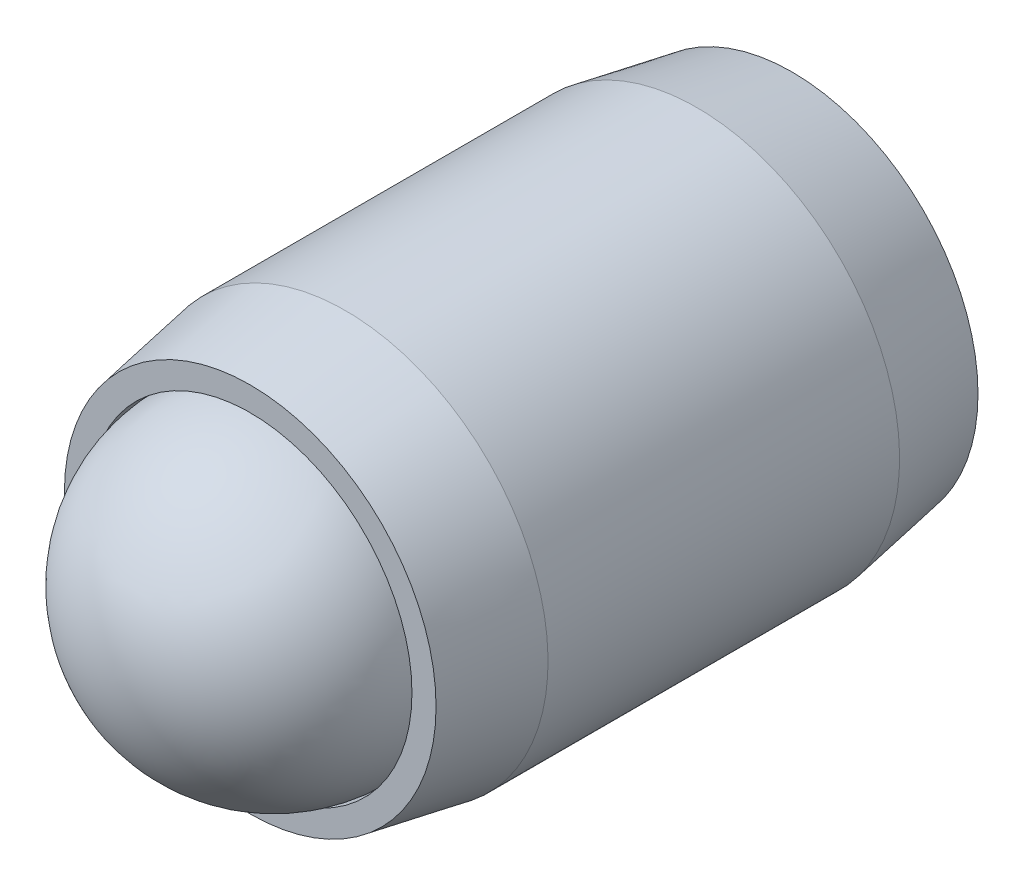
ISO-10303-21;
HEADER;
FILE_DESCRIPTION(('STEP AP214'),'2;1');
FILE_NAME('part.step','',(''),(''),'','','');
FILE_SCHEMA(('AUTOMOTIVE_DESIGN { 1 0 10303 214 1 1 1 1 }'));
ENDSEC;
DATA;
#1=APPLICATION_CONTEXT('core data for automotive mechanical design processes');
#2=APPLICATION_PROTOCOL_DEFINITION('international standard','automotive_design',2000,#1);
#3=PRODUCT_CONTEXT('',#1,'mechanical');
#4=PRODUCT('Part','Part','',(#3));
#5=PRODUCT_RELATED_PRODUCT_CATEGORY('part','',(#4));
#6=PRODUCT_DEFINITION_FORMATION('','',#4);
#7=PRODUCT_DEFINITION_CONTEXT('part definition',#1,'design');
#8=PRODUCT_DEFINITION('design','',#6,#7);
#9=PRODUCT_DEFINITION_SHAPE('','',#8);
#10=(LENGTH_UNIT() NAMED_UNIT(*) SI_UNIT(.MILLI.,.METRE.));
#11=(NAMED_UNIT(*) PLANE_ANGLE_UNIT() SI_UNIT($,.RADIAN.));
#12=(NAMED_UNIT(*) SI_UNIT($,.STERADIAN.) SOLID_ANGLE_UNIT());
#13=UNCERTAINTY_MEASURE_WITH_UNIT(LENGTH_MEASURE(1.E-05),#10,'distance_accuracy_value','');
#14=(GEOMETRIC_REPRESENTATION_CONTEXT(3) GLOBAL_UNCERTAINTY_ASSIGNED_CONTEXT((#13)) GLOBAL_UNIT_ASSIGNED_CONTEXT((#10,
#11,#12)) REPRESENTATION_CONTEXT('',''));
#15=CARTESIAN_POINT('',(0.,0.,0.));
#16=DIRECTION('',(0.,0.,1.));
#17=DIRECTION('',(1.,0.,0.));
#18=AXIS2_PLACEMENT_3D('',#15,#16,#17);
#19=CARTESIAN_POINT('',(0.,0.,4.));
#20=DIRECTION('',(0.,0.,-1.));
#21=DIRECTION('',(-1.,0.,0.));
#22=AXIS2_PLACEMENT_3D('',#19,#20,#21);
#23=CYLINDRICAL_SURFACE('',#22,2.991);
#24=CARTESIAN_POINT('',(0.,0.,2.59465636509867));
#25=DIRECTION('',(0.,0.,1.));
#26=DIRECTION('',(0.,-1.,0.));
#27=AXIS2_PLACEMENT_3D('',#24,#25,#26);
#28=CIRCLE('',#27,2.991);
#29=CARTESIAN_POINT('',(0.,-2.991,2.59465636509867));
#30=VERTEX_POINT('',#29);
#31=EDGE_CURVE('P0_E184',#30,#30,#28,.T.);
#32=ORIENTED_EDGE('',*,*,#31,.F.);
#33=EDGE_LOOP('',(#32));
#34=FACE_BOUND('',#33,.T.);
#35=CARTESIAN_POINT('',(0.,0.,-2.59465636509867));
#36=DIRECTION('',(0.,0.,1.));
#37=DIRECTION('',(0.,-1.,0.));
#38=AXIS2_PLACEMENT_3D('',#35,#36,#37);
#39=CIRCLE('',#38,2.991);
#40=CARTESIAN_POINT('',(0.,-2.991,-2.59465636509867));
#41=VERTEX_POINT('',#40);
#42=EDGE_CURVE('P0_E187',#41,#41,#39,.T.);
#43=ORIENTED_EDGE('',*,*,#42,.T.);
#44=EDGE_LOOP('',(#43));
#45=FACE_BOUND('',#44,.T.);
#46=ADVANCED_FACE('P0_F16',(#34,#45),#23,.T.);
#47=CARTESIAN_POINT('',(0.,0.,4.));
#48=DIRECTION('',(0.,0.,-1.));
#49=DIRECTION('',(0.,1.,0.));
#50=AXIS2_PLACEMENT_3D('',#47,#48,#49);
#51=CONICAL_SURFACE('',#50,2.7432,0.174532925199426);
#52=ORIENTED_EDGE('',*,*,#31,.T.);
#53=EDGE_LOOP('',(#52));
#54=FACE_BOUND('',#53,.T.);
#55=CARTESIAN_POINT('',(0.,0.,4.));
#56=DIRECTION('',(0.,0.,1.));
#57=DIRECTION('',(0.,-1.,0.));
#58=AXIS2_PLACEMENT_3D('',#55,#56,#57);
#59=CIRCLE('',#58,2.7432);
#60=CARTESIAN_POINT('',(0.,-2.7432,4.));
#61=VERTEX_POINT('',#60);
#62=EDGE_CURVE('P0_E200',#61,#61,#59,.T.);
#63=ORIENTED_EDGE('',*,*,#62,.F.);
#64=EDGE_LOOP('',(#63));
#65=FACE_BOUND('',#64,.T.);
#66=ADVANCED_FACE('P0_F162',(#54,#65),#51,.T.);
#67=CARTESIAN_POINT('',(0.,0.,4.));
#68=DIRECTION('',(0.,0.,1.));
#69=DIRECTION('',(1.,0.,0.));
#70=AXIS2_PLACEMENT_3D('',#67,#68,#69);
#71=PLANE('',#70);
#72=CARTESIAN_POINT('',(0.,0.,4.));
#73=DIRECTION('',(0.,0.,1.));
#74=DIRECTION('',(1.,0.,0.));
#75=AXIS2_PLACEMENT_3D('',#72,#73,#74);
#76=CIRCLE('',#75,2.3876);
#77=CARTESIAN_POINT('',(2.3876,0.,4.));
#78=VERTEX_POINT('',#77);
#79=EDGE_CURVE('P0_E195',#78,#78,#76,.T.);
#80=ORIENTED_EDGE('',*,*,#79,.F.);
#81=EDGE_LOOP('',(#80));
#82=FACE_BOUND('',#81,.T.);
#83=ORIENTED_EDGE('',*,*,#62,.T.);
#84=EDGE_LOOP('',(#83));
#85=FACE_BOUND('',#84,.T.);
#86=ADVANCED_FACE('P0_F159',(#82,#85),#71,.T.);
#87=CARTESIAN_POINT('',(0.,0.,-2.59465636509867));
#88=DIRECTION('',(0.,0.,1.));
#89=DIRECTION('',(0.,-1.,0.));
#90=AXIS2_PLACEMENT_3D('',#87,#88,#89);
#91=CONICAL_SURFACE('',#90,2.991,0.174532925199426);
#92=CARTESIAN_POINT('',(0.,0.,-4.));
#93=DIRECTION('',(0.,0.,1.));
#94=DIRECTION('',(0.,-1.,0.));
#95=AXIS2_PLACEMENT_3D('',#92,#93,#94);
#96=CIRCLE('',#95,2.7432);
#97=CARTESIAN_POINT('',(0.,-2.7432,-4.));
#98=VERTEX_POINT('',#97);
#99=EDGE_CURVE('P0_E189',#98,#98,#96,.T.);
#100=ORIENTED_EDGE('',*,*,#99,.T.);
#101=EDGE_LOOP('',(#100));
#102=FACE_BOUND('',#101,.T.);
#103=ORIENTED_EDGE('',*,*,#42,.F.);
#104=EDGE_LOOP('',(#103));
#105=FACE_BOUND('',#104,.T.);
#106=ADVANCED_FACE('P0_F161',(#102,#105),#91,.T.);
#107=CARTESIAN_POINT('',(0.,0.,-4.));
#108=DIRECTION('',(0.,0.,1.));
#109=DIRECTION('',(1.,0.,0.));
#110=AXIS2_PLACEMENT_3D('',#107,#108,#109);
#111=PLANE('',#110);
#112=CARTESIAN_POINT('',(0.,0.,-4.));
#113=DIRECTION('',(0.,0.,1.));
#114=DIRECTION('',(1.,0.,0.));
#115=AXIS2_PLACEMENT_3D('',#112,#113,#114);
#116=CIRCLE('',#115,1.14567944042316);
#117=CARTESIAN_POINT('',(0.572839720211582,-0.9921875,-4.));
#118=VERTEX_POINT('',#117);
#119=CARTESIAN_POINT('',(1.14567944042316,0.,-4.));
#120=VERTEX_POINT('',#119);
#121=EDGE_CURVE('P0_E19',#118,#120,#116,.T.);
#122=ORIENTED_EDGE('',*,*,#121,.T.);
#123=CARTESIAN_POINT('',(0.572839720211581,0.9921875,-4.));
#124=VERTEX_POINT('',#123);
#125=EDGE_CURVE('P0_E11',#120,#124,#116,.T.);
#126=ORIENTED_EDGE('',*,*,#125,.T.);
#127=CARTESIAN_POINT('',(-0.572839720211581,0.9921875,-4.));
#128=VERTEX_POINT('',#127);
#129=EDGE_CURVE('P0_E24',#124,#128,#116,.T.);
#130=ORIENTED_EDGE('',*,*,#129,.T.);
#131=CARTESIAN_POINT('',(0.,0.,-4.));
#132=DIRECTION('',(0.,0.,-1.));
#133=DIRECTION('',(-1.,0.,0.));
#134=AXIS2_PLACEMENT_3D('',#131,#132,#133);
#135=CIRCLE('',#134,1.14567944042316);
#136=CARTESIAN_POINT('',(-1.14567944042316,0.,-4.));
#137=VERTEX_POINT('',#136);
#138=EDGE_CURVE('P0_E77',#137,#128,#135,.T.);
#139=ORIENTED_EDGE('',*,*,#138,.F.);
#140=CARTESIAN_POINT('',(-0.572839720211582,-0.9921875,-4.));
#141=VERTEX_POINT('',#140);
#142=EDGE_CURVE('P0_E85',#137,#141,#116,.T.);
#143=ORIENTED_EDGE('',*,*,#142,.T.);
#144=EDGE_CURVE('P0_E90',#141,#118,#116,.T.);
#145=ORIENTED_EDGE('',*,*,#144,.T.);
#146=EDGE_LOOP('',(#122,#126,#130,#139,#143,#145));
#147=FACE_BOUND('',#146,.T.);
#148=ORIENTED_EDGE('',*,*,#99,.F.);
#149=EDGE_LOOP('',(#148));
#150=FACE_BOUND('',#149,.T.);
#151=ADVANCED_FACE('P0_F91',(#147,#150),#111,.F.);
#152=CARTESIAN_POINT('',(0.,0.,2.67075395459906));
#153=DIRECTION('',(0.,0.,1.));
#154=DIRECTION('',(1.,0.,0.));
#155=AXIS2_PLACEMENT_3D('',#152,#153,#154);
#156=CONICAL_SURFACE('',#155,2.3876,0.78539816339745);
#157=CARTESIAN_POINT('',(0.,0.,0.283153954599072));
#158=VERTEX_POINT('',#157);
#159=VERTEX_LOOP('',#158);
#160=FACE_BOUND('',#159,.T.);
#161=CARTESIAN_POINT('',(0.,0.,2.67075395459906));
#162=DIRECTION('',(0.,0.,1.));
#163=DIRECTION('',(1.,0.,0.));
#164=AXIS2_PLACEMENT_3D('',#161,#162,#163);
#165=CIRCLE('',#164,2.3876);
#166=CARTESIAN_POINT('',(2.3876,0.,2.67075395459906));
#167=VERTEX_POINT('',#166);
#168=EDGE_CURVE('P0_E190',#167,#167,#165,.T.);
#169=ORIENTED_EDGE('',*,*,#168,.T.);
#170=EDGE_LOOP('',(#169));
#171=FACE_BOUND('',#170,.T.);
#172=ADVANCED_FACE('P0_F165',(#160,#171),#156,.F.);
#173=CARTESIAN_POINT('',(0.,0.,4.));
#174=DIRECTION('',(0.,0.,1.));
#175=DIRECTION('',(1.,0.,0.));
#176=AXIS2_PLACEMENT_3D('',#173,#174,#175);
#177=CYLINDRICAL_SURFACE('',#176,2.3876);
#178=ORIENTED_EDGE('',*,*,#168,.F.);
#179=EDGE_LOOP('',(#178));
#180=FACE_BOUND('',#179,.T.);
#181=ORIENTED_EDGE('',*,*,#79,.T.);
#182=EDGE_LOOP('',(#181));
#183=FACE_BOUND('',#182,.T.);
#184=ADVANCED_FACE('P0_F132',(#180,#183),#177,.F.);
#185=CARTESIAN_POINT('',(0.,0.,-4.));
#186=DIRECTION('',(0.,0.,-1.));
#187=DIRECTION('',(-1.,0.,0.));
#188=AXIS2_PLACEMENT_3D('',#185,#186,#187);
#189=CONICAL_SURFACE('',#188,1.14567944042316,0.78539816339745);
#190=ORIENTED_EDGE('',*,*,#121,.F.);
#191=CARTESIAN_POINT('',(1.145794910477,0.000200000000000088,-4.00011548750897));
#192=CARTESIAN_POINT('',(1.12609913995856,-0.0339140752321559,-3.98043281140465));
#193=CARTESIAN_POINT('',(1.10607402631377,-0.0685985894922798,-3.96190568451841));
#194=CARTESIAN_POINT('',(1.06524035596264,-0.139324581199959,-3.92798232965041));
#195=CARTESIAN_POINT('',(1.04442791197037,-0.175372791624243,-3.91260498723095));
#196=CARTESIAN_POINT('',(1.00246048249572,-0.248062511737396,-3.88626314273428));
#197=CARTESIAN_POINT('',(0.981316196707012,-0.284685489013202,-3.87523239651314));
#198=CARTESIAN_POINT('',(0.938562244623588,-0.358737506246057,-3.85823620567294));
#199=CARTESIAN_POINT('',(0.916953885244212,-0.396164282559343,-3.85225806757892));
#200=CARTESIAN_POINT('',(0.879714587318153,-0.460664638605472,-3.84686634491429));
#201=CARTESIAN_POINT('',(0.864132099442441,-0.48765429931453,-3.84606899638834));
#202=CARTESIAN_POINT('',(0.832997298779852,-0.541581355945665,-3.84740819336142));
#203=CARTESIAN_POINT('',(0.817444993408172,-0.56851873902424,-3.84954538613705));
#204=CARTESIAN_POINT('',(0.771010163908484,-0.648946222958498,-3.86021757130602));
#205=CARTESIAN_POINT('',(0.740358726795445,-0.702036069363283,-3.87301438072271));
#206=CARTESIAN_POINT('',(0.686562055130079,-0.795214637965798,-3.90389746765013));
#207=CARTESIAN_POINT('',(0.663164549602744,-0.835740306309517,-3.92036500890771));
#208=CARTESIAN_POINT('',(0.617285982385523,-0.915204315708207,-3.95746038355681));
#209=CARTESIAN_POINT('',(0.594802217831308,-0.954147338261523,-3.97807468064554));
#210=CARTESIAN_POINT('',(0.572724250157744,-0.9923875,-4.00011548750897));
#211=B_SPLINE_CURVE_WITH_KNOTS('',3,(#191,#192,#193,#194,#195,#196,#197,#198,#199,#200,#201,
#202,#203,#204,#205,#206,#207,#208,#209,#210),.UNSPECIFIED.,.F.,.F.,(4,2,2,2,2,2,2,2,2,4),(0.,
0.132197185210191,0.265165186853263,0.39602009760567,0.526545281028575,0.619935205043266,
0.713345731536166,0.90022005184637,1.04884529769095,1.1969930355767),.UNSPECIFIED.);
#212=EDGE_CURVE('P0_E109',#120,#118,#211,.T.);
#213=ORIENTED_EDGE('',*,*,#212,.F.);
#214=EDGE_LOOP('',(#190,#213));
#215=FACE_BOUND('',#214,.T.);
#216=ADVANCED_FACE('P0_F127',(#215),#189,.F.);
#217=ORIENTED_EDGE('',*,*,#144,.F.);
#218=CARTESIAN_POINT('',(-1.14247621078911,-0.9921875,-4.36749203940828));
#219=CARTESIAN_POINT('',(-1.11465764801141,-0.9921875,-4.3464916392497));
#220=CARTESIAN_POINT('',(-1.08668408094051,-0.9921875,-4.32569714770579));
#221=CARTESIAN_POINT('',(-1.03036405365904,-0.9921875,-4.28460503768691));
#222=CARTESIAN_POINT('',(-1.00201750223733,-0.9921875,-4.26430754435707));
#223=CARTESIAN_POINT('',(-0.915909012346496,-0.9921875,-4.20399850749393));
#224=CARTESIAN_POINT('',(-0.857501195839066,-0.9921875,-4.16489385217264));
#225=CARTESIAN_POINT('',(-0.735022281240404,-0.9921875,-4.08812675276114));
#226=CARTESIAN_POINT('',(-0.670818221894543,-0.9921875,-4.05067403099626));
#227=CARTESIAN_POINT('',(-0.539203244212803,-0.9921875,-3.98216502046105));
#228=CARTESIAN_POINT('',(-0.471804118965062,-0.9921875,-3.95108716825431));
#229=CARTESIAN_POINT('',(-0.370637445252798,-0.9921875,-3.91306629623627));
#230=CARTESIAN_POINT('',(-0.338367677251604,-0.9921875,-3.90215403233245));
#231=CARTESIAN_POINT('',(-0.273049086247197,-0.9921875,-3.88292023009933));
#232=CARTESIAN_POINT('',(-0.240000209742886,-0.9921875,-3.87459887024719));
#233=CARTESIAN_POINT('',(-0.173878395816094,-0.9921875,-3.86111877368215));
#234=CARTESIAN_POINT('',(-0.14081677471647,-0.9921875,-3.85590539396509));
#235=CARTESIAN_POINT('',(-0.074329167199214,-0.9921875,-3.84873971245706));
#236=CARTESIAN_POINT('',(-0.040903125991957,-0.9921875,-3.84678790803543));
#237=CARTESIAN_POINT('',(0.0247631141129258,-0.9921875,-3.84629348590571));
#238=CARTESIAN_POINT('',(0.0570024445003674,-0.9921875,-3.84763003142075));
#239=CARTESIAN_POINT('',(0.121194220501071,-0.9921875,-3.85337104321384));
#240=CARTESIAN_POINT('',(0.153146730366263,-0.9921875,-3.85777480409387));
#241=CARTESIAN_POINT('',(0.217090524657737,-0.9921875,-3.86948451115969));
#242=CARTESIAN_POINT('',(0.249072542149665,-0.9921875,-3.87684030243665));
#243=CARTESIAN_POINT('',(0.312337779758396,-0.9921875,-3.8940630913854));
#244=CARTESIAN_POINT('',(0.343621058108106,-0.9921875,-3.90392987893501));
#245=CARTESIAN_POINT('',(0.442112983138563,-0.9921875,-3.93870611159688));
#246=CARTESIAN_POINT('',(0.50791977119888,-0.9921875,-3.96757616415081));
#247=CARTESIAN_POINT('',(0.636441891183645,-0.9921875,-4.03176520992333));
#248=CARTESIAN_POINT('',(0.699145053961295,-0.9921875,-4.06710737220965));
#249=CARTESIAN_POINT('',(0.818979830095495,-0.9921875,-4.14002137086766));
#250=CARTESIAN_POINT('',(0.876233471712469,-0.9921875,-4.17739513504847));
#251=CARTESIAN_POINT('',(0.960585190784999,-0.9921875,-4.23517111190454));
#252=CARTESIAN_POINT('',(0.98833837842419,-0.9921875,-4.25463348767096));
#253=CARTESIAN_POINT('',(1.04346551341387,-0.9921875,-4.29407298177173));
#254=CARTESIAN_POINT('',(1.07083956239906,-0.9921875,-4.31404995788478));
#255=CARTESIAN_POINT('',(1.09805574523311,-0.9921875,-4.33424030564271));
#256=B_SPLINE_CURVE_WITH_KNOTS('',3,(#218,#219,#220,#221,#222,#223,#224,#225,#226,#227,#228,
#229,#230,#231,#232,#233,#234,#235,#236,#237,#238,#239,#240,#241,#242,#243,#244,#245,#246,#247,
#248,#249,#250,#251,#252,#253,#254,#255),.UNSPECIFIED.,.F.,.F.,(4,2,2,2,2,2,2,2,2,2,2,2,2,2,2,2,
2,2,4),(0.,0.104563127371702,0.209152318679108,0.419927098975113,0.642732653870155,
0.864771652131276,0.966879847039377,1.06899507422301,1.16925752982867,1.26953527342202,
1.36618351686957,1.46280954049584,1.56114078094885,1.65946379566813,1.87441437168727,
2.09015003608822,2.29516517576016,2.39685303378669,2.49851308339968),.UNSPECIFIED.);
#257=EDGE_CURVE('P0_E107',#118,#141,#256,.F.);
#258=ORIENTED_EDGE('',*,*,#257,.F.);
#259=EDGE_LOOP('',(#217,#258));
#260=FACE_BOUND('',#259,.T.);
#261=ADVANCED_FACE('P0_F131',(#260),#189,.F.);
#262=ORIENTED_EDGE('',*,*,#142,.F.);
#263=CARTESIAN_POINT('',(-0.572724250157744,-0.9923875,-4.00011548750897));
#264=CARTESIAN_POINT('',(-0.592420020676185,-0.958273424767844,-3.98043281140465));
#265=CARTESIAN_POINT('',(-0.612445134320978,-0.92358891050772,-3.96190568451841));
#266=CARTESIAN_POINT('',(-0.653278804672111,-0.85286291880004,-3.92798232965041));
#267=CARTESIAN_POINT('',(-0.674091248664375,-0.816814708375757,-3.91260498723095));
#268=CARTESIAN_POINT('',(-0.716058678139022,-0.744124988262603,-3.88626314273428));
#269=CARTESIAN_POINT('',(-0.737202963927734,-0.707502010986798,-3.87523239651314));
#270=CARTESIAN_POINT('',(-0.779956916011158,-0.633449993753943,-3.85823620567294));
#271=CARTESIAN_POINT('',(-0.801565275390534,-0.596023217440656,-3.85225806757892));
#272=CARTESIAN_POINT('',(-0.838804573316593,-0.531522861394528,-3.84686634491429));
#273=CARTESIAN_POINT('',(-0.854387061192304,-0.50453320068547,-3.84606899638834));
#274=CARTESIAN_POINT('',(-0.885521861854894,-0.450606144054335,-3.84740819336142));
#275=CARTESIAN_POINT('',(-0.901074167226574,-0.42366876097576,-3.84954538613705));
#276=CARTESIAN_POINT('',(-0.947508996726262,-0.343241277041502,-3.86021757130602));
#277=CARTESIAN_POINT('',(-0.978160433839301,-0.290151430636716,-3.87301438072271));
#278=CARTESIAN_POINT('',(-1.03195710550467,-0.196972862034202,-3.90389746765013));
#279=CARTESIAN_POINT('',(-1.055354611032,-0.156447193690483,-3.92036500890771));
#280=CARTESIAN_POINT('',(-1.10123317824922,-0.0769831842917924,-3.95746038355681));
#281=CARTESIAN_POINT('',(-1.12371694280344,-0.0380401617384764,-3.97807468064554));
#282=CARTESIAN_POINT('',(-1.145794910477,0.00019999999999987,-4.00011548750897));
#283=B_SPLINE_CURVE_WITH_KNOTS('',3,(#263,#264,#265,#266,#267,#268,#269,#270,#271,#272,#273,
#274,#275,#276,#277,#278,#279,#280,#281,#282),.UNSPECIFIED.,.F.,.F.,(4,2,2,2,2,2,2,2,2,4),(0.,
0.13219718521019,0.265165186853263,0.39602009760567,0.526545281028575,0.619935205043265,
0.713345731536165,0.90022005184637,1.04884529769095,1.19699303557669),.UNSPECIFIED.);
#284=EDGE_CURVE('P0_E80',#141,#137,#283,.T.);
#285=ORIENTED_EDGE('',*,*,#284,.F.);
#286=EDGE_LOOP('',(#262,#285));
#287=FACE_BOUND('',#286,.T.);
#288=ADVANCED_FACE('P0_F86',(#287),#189,.F.);
#289=ORIENTED_EDGE('',*,*,#138,.T.);
#290=CARTESIAN_POINT('',(-1.145794910477,-0.00019999999999985,-4.00011548750897));
#291=CARTESIAN_POINT('',(-1.12609913995856,0.0339140752321559,-3.98043281140465));
#292=CARTESIAN_POINT('',(-1.10607402631377,0.0685985894922795,-3.96190568451841));
#293=CARTESIAN_POINT('',(-1.06524035596264,0.139324581199959,-3.92798232965041));
#294=CARTESIAN_POINT('',(-1.04442791197037,0.175372791624242,-3.91260498723095));
#295=CARTESIAN_POINT('',(-1.00246048249572,0.248062511737396,-3.88626314273428));
#296=CARTESIAN_POINT('',(-0.981316196707011,0.284685489013201,-3.87523239651314));
#297=CARTESIAN_POINT('',(-0.938562244623588,0.358737506246056,-3.85823620567294));
#298=CARTESIAN_POINT('',(-0.916953885244212,0.396164282559343,-3.85225806757892));
#299=CARTESIAN_POINT('',(-0.879714587318153,0.460664638605471,-3.84686634491429));
#300=CARTESIAN_POINT('',(-0.864132099442442,0.487654299314529,-3.84606899638834));
#301=CARTESIAN_POINT('',(-0.832997298779852,0.541581355945664,-3.84740819336142));
#302=CARTESIAN_POINT('',(-0.817444993408172,0.568518739024239,-3.84954538613705));
#303=CARTESIAN_POINT('',(-0.771010163908484,0.648946222958497,-3.86021757130602));
#304=CARTESIAN_POINT('',(-0.740358726795446,0.702036069363283,-3.87301438072271));
#305=CARTESIAN_POINT('',(-0.68656205513008,0.795214637965797,-3.90389746765013));
#306=CARTESIAN_POINT('',(-0.663164549602744,0.835740306309517,-3.92036500890771));
#307=CARTESIAN_POINT('',(-0.617285982385522,0.915204315708207,-3.95746038355681));
#308=CARTESIAN_POINT('',(-0.594802217831308,0.954147338261524,-3.97807468064554));
#309=CARTESIAN_POINT('',(-0.572724250157744,0.9923875,-4.00011548750897));
#310=B_SPLINE_CURVE_WITH_KNOTS('',3,(#290,#291,#292,#293,#294,#295,#296,#297,#298,#299,#300,
#301,#302,#303,#304,#305,#306,#307,#308,#309),.UNSPECIFIED.,.F.,.F.,(4,2,2,2,2,2,2,2,2,4),(0.,
0.13219718521019,0.265165186853262,0.396020097605669,0.526545281028574,0.619935205043264,
0.713345731536164,0.900220051846369,1.04884529769095,1.1969930355767),.UNSPECIFIED.);
#311=EDGE_CURVE('P0_E73',#137,#128,#310,.T.);
#312=ORIENTED_EDGE('',*,*,#311,.F.);
#313=EDGE_LOOP('',(#289,#312));
#314=FACE_BOUND('',#313,.T.);
#315=ADVANCED_FACE('P0_F75',(#314),#189,.F.);
#316=ORIENTED_EDGE('',*,*,#129,.F.);
#317=CARTESIAN_POINT('',(-1.14247621095534,0.9921875,-4.36749203953379));
#318=CARTESIAN_POINT('',(-1.11465764817297,0.9921875,-4.34649163937037));
#319=CARTESIAN_POINT('',(-1.08668408109739,0.9921875,-4.32569714782163));
#320=CARTESIAN_POINT('',(-1.03036405380652,0.9921875,-4.28460503779312));
#321=CARTESIAN_POINT('',(-1.00201750238008,0.9921875,-4.26430754445849));
#322=CARTESIAN_POINT('',(-0.915909012474783,0.9921875,-4.20399850758086));
#323=CARTESIAN_POINT('',(-0.857501195957518,0.9921875,-4.16489385224995));
#324=CARTESIAN_POINT('',(-0.735022281337405,0.9921875,-4.08812675281867));
#325=CARTESIAN_POINT('',(-0.670818221979871,0.9921875,-4.0506740310437));
#326=CARTESIAN_POINT('',(-0.539203244273795,0.9921875,-3.98216502048978));
#327=CARTESIAN_POINT('',(-0.471804119013397,0.9921875,-3.95108716827442));
#328=CARTESIAN_POINT('',(-0.370637445291611,0.9921875,-3.91306629624996));
#329=CARTESIAN_POINT('',(-0.338367677294404,0.9921875,-3.9021540323464));
#330=CARTESIAN_POINT('',(-0.273049086298104,0.9921875,-3.88292023011298));
#331=CARTESIAN_POINT('',(-0.240000209797912,0.9921875,-3.87459887026028));
#332=CARTESIAN_POINT('',(-0.173878395879219,0.9921875,-3.86111877369319));
#333=CARTESIAN_POINT('',(-0.140816774783574,0.9921875,-3.85590539397466));
#334=CARTESIAN_POINT('',(-0.074329167274146,0.9921875,-3.8487397124628));
#335=CARTESIAN_POINT('',(-0.0409031260707377,0.9921875,-3.8467879080388));
#336=CARTESIAN_POINT('',(0.0247631140270454,0.9921875,-3.84629348590368));
#337=CARTESIAN_POINT('',(0.0570024444112259,0.9921875,-3.84763003141573));
#338=CARTESIAN_POINT('',(0.121194220405734,0.9921875,-3.85337104320236));
#339=CARTESIAN_POINT('',(0.153146730267991,0.9921875,-3.85777480407894));
#340=CARTESIAN_POINT('',(0.217090524553671,0.9921875,-3.86948451113752));
#341=CARTESIAN_POINT('',(0.249072542042749,0.9921875,-3.87684030241066));
#342=CARTESIAN_POINT('',(0.312337779646056,0.9921875,-3.89406309135171));
#343=CARTESIAN_POINT('',(0.34362105799319,0.9921875,-3.90392987889742));
#344=CARTESIAN_POINT('',(0.442112982998624,0.9921875,-3.93870611154092));
#345=CARTESIAN_POINT('',(0.507919771037747,0.9921875,-3.96757616407796));
#346=CARTESIAN_POINT('',(0.636441890981752,0.9921875,-4.03176520981482));
#347=CARTESIAN_POINT('',(0.699145053739845,0.9921875,-4.06710737208238));
#348=CARTESIAN_POINT('',(0.818979829838884,0.9921875,-4.14002137070446));
#349=CARTESIAN_POINT('',(0.876233471440129,0.9921875,-4.17739513486827));
#350=CARTESIAN_POINT('',(0.960585190489402,0.9921875,-4.23517111169895));
#351=CARTESIAN_POINT('',(0.988338378120952,0.9921875,-4.25463348745697));
#352=CARTESIAN_POINT('',(1.0434655130954,0.9921875,-4.29407298154095));
#353=CARTESIAN_POINT('',(1.070839562073,0.9921875,-4.31404995764561));
#354=CARTESIAN_POINT('',(1.09805574489947,0.9921875,-4.33424030539516));
#355=B_SPLINE_CURVE_WITH_KNOTS('',3,(#317,#318,#319,#320,#321,#322,#323,#324,#325,#326,#327,
#328,#329,#330,#331,#332,#333,#334,#335,#336,#337,#338,#339,#340,#341,#342,#343,#344,#345,#346,
#347,#348,#349,#350,#351,#352,#353,#354),.UNSPECIFIED.,.F.,.F.,(4,2,2,2,2,2,2,2,2,2,2,2,2,2,2,2,
2,2,4),(0.,0.104563127391605,0.209152318718919,0.419927099055486,0.642732653996013,
0.864771652302187,0.966879847198757,1.06899507437088,1.1692575299655,1.2695352735478,
1.36618351698525,1.4628095406014,1.56114078104352,1.65946379575192,1.87441437169281,
2.090150036015,2.29516517561956,2.39685303361285,2.4985130831926),.UNSPECIFIED.);
#356=EDGE_CURVE('P0_E81',#128,#124,#355,.T.);
#357=ORIENTED_EDGE('',*,*,#356,.F.);
#358=EDGE_LOOP('',(#316,#357));
#359=FACE_BOUND('',#358,.T.);
#360=ADVANCED_FACE('P0_F231',(#359),#189,.F.);
#361=ORIENTED_EDGE('',*,*,#125,.F.);
#362=CARTESIAN_POINT('',(0.572724250157744,0.9923875,-4.00011548750897));
#363=CARTESIAN_POINT('',(0.592420020676184,0.958273424767844,-3.98043281140465));
#364=CARTESIAN_POINT('',(0.612445134320978,0.92358891050772,-3.96190568451841));
#365=CARTESIAN_POINT('',(0.65327880467211,0.852862918800041,-3.92798232965041));
#366=CARTESIAN_POINT('',(0.674091248664374,0.816814708375758,-3.91260498723095));
#367=CARTESIAN_POINT('',(0.716058678139022,0.744124988262604,-3.88626314273428));
#368=CARTESIAN_POINT('',(0.737202963927734,0.707502010986799,-3.87523239651314));
#369=CARTESIAN_POINT('',(0.779956916011158,0.633449993753943,-3.85823620567294));
#370=CARTESIAN_POINT('',(0.801565275390533,0.596023217440657,-3.85225806757892));
#371=CARTESIAN_POINT('',(0.838804573316592,0.531522861394529,-3.84686634491429));
#372=CARTESIAN_POINT('',(0.854387061192304,0.50453320068547,-3.84606899638834));
#373=CARTESIAN_POINT('',(0.885521861854894,0.450606144054336,-3.84740819336142));
#374=CARTESIAN_POINT('',(0.901074167226573,0.42366876097576,-3.84954538613705));
#375=CARTESIAN_POINT('',(0.947508996726261,0.343241277041503,-3.86021757130602));
#376=CARTESIAN_POINT('',(0.9781604338393,0.290151430636717,-3.87301438072271));
#377=CARTESIAN_POINT('',(1.03195710550467,0.196972862034203,-3.90389746765013));
#378=CARTESIAN_POINT('',(1.055354611032,0.156447193690484,-3.92036500890771));
#379=CARTESIAN_POINT('',(1.10123317824922,0.0769831842917929,-3.95746038355681));
#380=CARTESIAN_POINT('',(1.12371694280344,0.0380401617384766,-3.97807468064554));
#381=CARTESIAN_POINT('',(1.145794910477,-0.00019999999999992,-4.00011548750897));
#382=B_SPLINE_CURVE_WITH_KNOTS('',3,(#362,#363,#364,#365,#366,#367,#368,#369,#370,#371,#372,
#373,#374,#375,#376,#377,#378,#379,#380,#381),.UNSPECIFIED.,.F.,.F.,(4,2,2,2,2,2,2,2,2,4),(0.,
0.13219718521019,0.265165186853263,0.39602009760567,0.526545281028574,0.619935205043265,
0.713345731536164,0.900220051846369,1.04884529769095,1.1969930355767),.UNSPECIFIED.);
#383=EDGE_CURVE('P0_E94',#124,#120,#382,.T.);
#384=ORIENTED_EDGE('',*,*,#383,.F.);
#385=EDGE_LOOP('',(#361,#384));
#386=FACE_BOUND('',#385,.T.);
#387=ADVANCED_FACE('P0_F134',(#386),#189,.F.);
#388=CARTESIAN_POINT('',(0.,0.,-0.952));
#389=DIRECTION('',(0.,0.,-1.));
#390=DIRECTION('',(-1.,0.,0.));
#391=AXIS2_PLACEMENT_3D('',#388,#389,#390);
#392=PLANE('',#391);
#393=DIRECTION('',(1.,0.,0.));
#394=VECTOR('',#393,1.);
#395=CARTESIAN_POINT('',(-0.572839720211581,0.9921875,-0.952));
#396=LINE('',#395,#394);
#397=CARTESIAN_POINT('',(-0.572839720211581,0.9921875,-0.952));
#398=VERTEX_POINT('',#397);
#399=CARTESIAN_POINT('',(0.572839720211582,0.9921875,-0.952));
#400=VERTEX_POINT('',#399);
#401=EDGE_CURVE('P0_E203',#398,#400,#396,.T.);
#402=ORIENTED_EDGE('',*,*,#401,.T.);
#403=DIRECTION('',(0.5,-0.866025403784439,0.));
#404=VECTOR('',#403,1.);
#405=CARTESIAN_POINT('',(0.572839720211582,0.9921875,-0.952));
#406=LINE('',#405,#404);
#407=CARTESIAN_POINT('',(1.14567944042316,0.,-0.952));
#408=VERTEX_POINT('',#407);
#409=EDGE_CURVE('P0_E206',#400,#408,#406,.T.);
#410=ORIENTED_EDGE('',*,*,#409,.T.);
#411=DIRECTION('',(-0.5,-0.866025403784439,0.));
#412=VECTOR('',#411,1.);
#413=CARTESIAN_POINT('',(1.14567944042316,0.,-0.952));
#414=LINE('',#413,#412);
#415=CARTESIAN_POINT('',(0.572839720211582,-0.9921875,-0.952));
#416=VERTEX_POINT('',#415);
#417=EDGE_CURVE('P0_E209',#408,#416,#414,.T.);
#418=ORIENTED_EDGE('',*,*,#417,.T.);
#419=DIRECTION('',(-1.,0.,0.));
#420=VECTOR('',#419,1.);
#421=CARTESIAN_POINT('',(0.572839720211582,-0.9921875,-0.952));
#422=LINE('',#421,#420);
#423=CARTESIAN_POINT('',(-0.572839720211582,-0.9921875,-0.952));
#424=VERTEX_POINT('',#423);
#425=EDGE_CURVE('P0_E212',#416,#424,#422,.T.);
#426=ORIENTED_EDGE('',*,*,#425,.T.);
#427=DIRECTION('',(-0.5,0.866025403784439,0.));
#428=VECTOR('',#427,1.);
#429=CARTESIAN_POINT('',(-0.572839720211582,-0.9921875,-0.952));
#430=LINE('',#429,#428);
#431=CARTESIAN_POINT('',(-1.14567944042316,0.,-0.952));
#432=VERTEX_POINT('',#431);
#433=EDGE_CURVE('P0_E215',#424,#432,#430,.T.);
#434=ORIENTED_EDGE('',*,*,#433,.T.);
#435=DIRECTION('',(0.5,0.866025403784439,0.));
#436=VECTOR('',#435,1.);
#437=CARTESIAN_POINT('',(-1.14567944042316,0.,-0.952));
#438=LINE('',#437,#436);
#439=EDGE_CURVE('P0_E99',#432,#398,#438,.T.);
#440=ORIENTED_EDGE('',*,*,#439,.T.);
#441=EDGE_LOOP('',(#402,#410,#418,#426,#434,#440));
#442=FACE_BOUND('',#441,.T.);
#443=ADVANCED_FACE('P0_F240',(#442),#392,.T.);
#444=CARTESIAN_POINT('',(0.572839720211582,0.9921875,-0.952));
#445=DIRECTION('',(0.866025403784439,0.5,0.));
#446=DIRECTION('',(-0.5,0.866025403784439,0.));
#447=AXIS2_PLACEMENT_3D('',#444,#445,#446);
#448=PLANE('',#447);
#449=DIRECTION('',(0.,0.,-1.));
#450=VECTOR('',#449,1.);
#451=CARTESIAN_POINT('',(0.572839720211582,0.9921875,-0.952));
#452=LINE('',#451,#450);
#453=EDGE_CURVE('P0_E218',#400,#124,#452,.T.);
#454=ORIENTED_EDGE('',*,*,#453,.T.);
#455=ORIENTED_EDGE('',*,*,#383,.T.);
#456=DIRECTION('',(0.,0.,-1.));
#457=VECTOR('',#456,1.);
#458=CARTESIAN_POINT('',(1.14567944042316,0.,-0.952));
#459=LINE('',#458,#457);
#460=EDGE_CURVE('P0_E224',#408,#120,#459,.T.);
#461=ORIENTED_EDGE('',*,*,#460,.F.);
#462=ORIENTED_EDGE('',*,*,#409,.F.);
#463=EDGE_LOOP('',(#454,#455,#461,#462));
#464=FACE_BOUND('',#463,.T.);
#465=ADVANCED_FACE('P0_F155',(#464),#448,.F.);
#466=CARTESIAN_POINT('',(-0.572839720211581,0.9921875,-0.952));
#467=DIRECTION('',(0.,1.,0.));
#468=DIRECTION('',(-1.,0.,0.));
#469=AXIS2_PLACEMENT_3D('',#466,#467,#468);
#470=PLANE('',#469);
#471=DIRECTION('',(0.,0.,-1.));
#472=VECTOR('',#471,1.);
#473=CARTESIAN_POINT('',(-0.572839720211581,0.9921875,-0.952));
#474=LINE('',#473,#472);
#475=EDGE_CURVE('P0_E37',#398,#128,#474,.T.);
#476=ORIENTED_EDGE('',*,*,#475,.T.);
#477=ORIENTED_EDGE('',*,*,#356,.T.);
#478=ORIENTED_EDGE('',*,*,#453,.F.);
#479=ORIENTED_EDGE('',*,*,#401,.F.);
#480=EDGE_LOOP('',(#476,#477,#478,#479));
#481=FACE_BOUND('',#480,.T.);
#482=ADVANCED_FACE('P0_F151',(#481),#470,.F.);
#483=CARTESIAN_POINT('',(-1.14567944042316,0.,-0.952));
#484=DIRECTION('',(-0.866025403784439,0.5,0.));
#485=DIRECTION('',(-0.5,-0.866025403784439,0.));
#486=AXIS2_PLACEMENT_3D('',#483,#484,#485);
#487=PLANE('',#486);
#488=DIRECTION('',(0.,0.,-1.));
#489=VECTOR('',#488,1.);
#490=CARTESIAN_POINT('',(-1.14567944042316,0.,-0.952));
#491=LINE('',#490,#489);
#492=EDGE_CURVE('P0_E96',#432,#137,#491,.T.);
#493=ORIENTED_EDGE('',*,*,#492,.T.);
#494=ORIENTED_EDGE('',*,*,#311,.T.);
#495=ORIENTED_EDGE('',*,*,#475,.F.);
#496=ORIENTED_EDGE('',*,*,#439,.F.);
#497=EDGE_LOOP('',(#493,#494,#495,#496));
#498=FACE_BOUND('',#497,.T.);
#499=ADVANCED_FACE('P0_F97',(#498),#487,.F.);
#500=CARTESIAN_POINT('',(-0.572839720211582,-0.9921875,-0.952));
#501=DIRECTION('',(-0.866025403784439,-0.5,0.));
#502=DIRECTION('',(0.5,-0.866025403784439,0.));
#503=AXIS2_PLACEMENT_3D('',#500,#501,#502);
#504=PLANE('',#503);
#505=DIRECTION('',(0.,0.,-1.));
#506=VECTOR('',#505,1.);
#507=CARTESIAN_POINT('',(-0.572839720211582,-0.9921875,-0.952));
#508=LINE('',#507,#506);
#509=EDGE_CURVE('P0_E103',#424,#141,#508,.T.);
#510=ORIENTED_EDGE('',*,*,#509,.T.);
#511=ORIENTED_EDGE('',*,*,#284,.T.);
#512=ORIENTED_EDGE('',*,*,#492,.F.);
#513=ORIENTED_EDGE('',*,*,#433,.F.);
#514=EDGE_LOOP('',(#510,#511,#512,#513));
#515=FACE_BOUND('',#514,.T.);
#516=ADVANCED_FACE('P0_F105',(#515),#504,.F.);
#517=CARTESIAN_POINT('',(0.572839720211582,-0.9921875,-0.952));
#518=DIRECTION('',(0.,-1.,0.));
#519=DIRECTION('',(0.,0.,-1.));
#520=AXIS2_PLACEMENT_3D('',#517,#518,#519);
#521=PLANE('',#520);
#522=DIRECTION('',(0.,0.,-1.));
#523=VECTOR('',#522,1.);
#524=CARTESIAN_POINT('',(0.572839720211582,-0.9921875,-0.952));
#525=LINE('',#524,#523);
#526=EDGE_CURVE('P0_E221',#416,#118,#525,.T.);
#527=ORIENTED_EDGE('',*,*,#526,.T.);
#528=ORIENTED_EDGE('',*,*,#257,.T.);
#529=ORIENTED_EDGE('',*,*,#509,.F.);
#530=ORIENTED_EDGE('',*,*,#425,.F.);
#531=EDGE_LOOP('',(#527,#528,#529,#530));
#532=FACE_BOUND('',#531,.T.);
#533=ADVANCED_FACE('P0_F242',(#532),#521,.F.);
#534=CARTESIAN_POINT('',(1.14567944042316,0.,-0.952));
#535=DIRECTION('',(0.866025403784439,-0.5,0.));
#536=DIRECTION('',(0.5,0.866025403784439,0.));
#537=AXIS2_PLACEMENT_3D('',#534,#535,#536);
#538=PLANE('',#537);
#539=ORIENTED_EDGE('',*,*,#460,.T.);
#540=ORIENTED_EDGE('',*,*,#212,.T.);
#541=ORIENTED_EDGE('',*,*,#526,.F.);
#542=ORIENTED_EDGE('',*,*,#417,.F.);
#543=EDGE_LOOP('',(#539,#540,#541,#542));
#544=FACE_BOUND('',#543,.T.);
#545=ADVANCED_FACE('P0_F237',(#544),#538,.F.);
#546=CLOSED_SHELL('',(#46,#66,#86,#106,#151,#172,#184,#216,#261,#288,#315,#360,#387,#443,#465,
#482,#499,#516,#533,#545));
#547=MANIFOLD_SOLID_BREP('P0_B1',#546);
#548=CARTESIAN_POINT('',(0.,0.,3.65075));
#549=DIRECTION('',(-0.171347043878085,0.985210734083954,0.));
#550=DIRECTION('',(0.985210734083954,0.171347043878085,0.));
#551=AXIS2_PLACEMENT_3D('',#548,#549,#550);
#552=SPHERICAL_SURFACE('',#551,2.38125);
#553=CARTESIAN_POINT('',(0.,0.,3.65075));
#554=DIRECTION('',(0.,0.,-1.));
#555=DIRECTION('',(0.985210734083953,0.171347043878085,0.));
#556=AXIS2_PLACEMENT_3D('',#553,#554,#555);
#557=SPHERICAL_SURFACE('',#556,2.38125);
#558=CARTESIAN_POINT('',(0.,0.,3.65075));
#559=DIRECTION('',(0.,0.,-1.));
#560=DIRECTION('',(0.985210734083954,0.171347043878085,0.));
#561=AXIS2_PLACEMENT_3D('',#558,#559,#560);
#562=CIRCLE('',#561,2.38125);
#563=CARTESIAN_POINT('',(2.34603306053742,0.408020148234689,3.65075));
#564=VERTEX_POINT('',#563);
#565=EDGE_CURVE('P1_E9',#564,#564,#562,.T.);
#566=ORIENTED_EDGE('',*,*,#565,.T.);
#567=EDGE_LOOP('',(#566));
#568=FACE_BOUND('',#567,.T.);
#569=ADVANCED_FACE('P1_F13',(#568),#557,.T.);
#570=CARTESIAN_POINT('',(0.,0.,3.65075));
#571=DIRECTION('',(0.,0.,-1.));
#572=DIRECTION('',(0.985210734083953,0.171347043878085,0.));
#573=AXIS2_PLACEMENT_3D('',#570,#571,#572);
#574=SPHERICAL_SURFACE('',#573,2.38125);
#575=ORIENTED_EDGE('',*,*,#565,.F.);
#576=EDGE_LOOP('',(#575));
#577=FACE_BOUND('',#576,.T.);
#578=ADVANCED_FACE('P1_F15',(#577),#574,.T.);
#579=CLOSED_SHELL('',(#569,#578));
#580=MANIFOLD_SOLID_BREP('P1_B1',#579);
#581=ADVANCED_BREP_SHAPE_REPRESENTATION('',(#18,#547,#580),#14);
#582=SHAPE_DEFINITION_REPRESENTATION(#9,#581);
ENDSEC;
END-ISO-10303-21;
